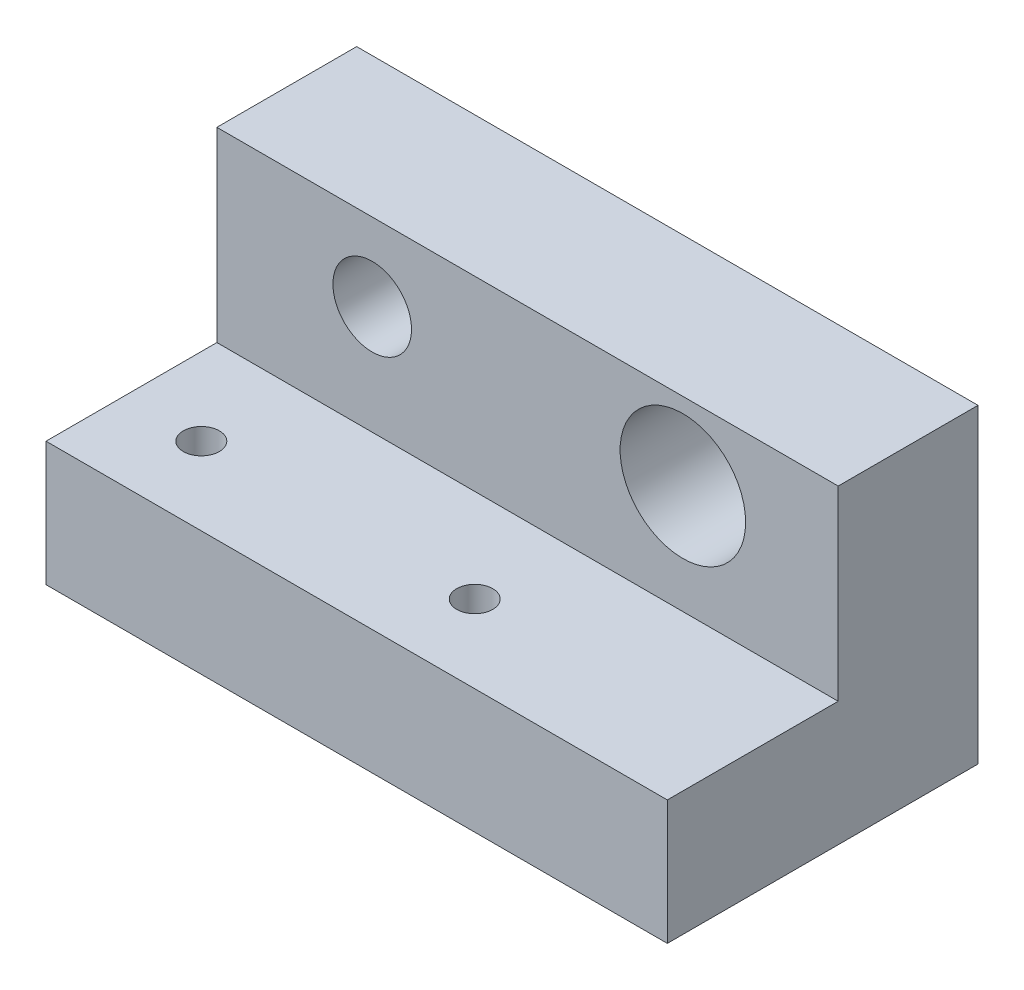
ISO-10303-21;
HEADER;
FILE_DESCRIPTION(('STEP AP214'),'2;1');
FILE_NAME('part.step','',(''),(''),'','','');
FILE_SCHEMA(('AUTOMOTIVE_DESIGN { 1 0 10303 214 1 1 1 1 }'));
ENDSEC;
DATA;
#1=APPLICATION_CONTEXT('core data for automotive mechanical design processes');
#2=APPLICATION_PROTOCOL_DEFINITION('international standard','automotive_design',2000,#1);
#3=PRODUCT_CONTEXT('',#1,'mechanical');
#4=PRODUCT('Part','Part','',(#3));
#5=PRODUCT_RELATED_PRODUCT_CATEGORY('part','',(#4));
#6=PRODUCT_DEFINITION_FORMATION('','',#4);
#7=PRODUCT_DEFINITION_CONTEXT('part definition',#1,'design');
#8=PRODUCT_DEFINITION('design','',#6,#7);
#9=PRODUCT_DEFINITION_SHAPE('','',#8);
#10=(LENGTH_UNIT() NAMED_UNIT(*) SI_UNIT(.MILLI.,.METRE.));
#11=(NAMED_UNIT(*) PLANE_ANGLE_UNIT() SI_UNIT($,.RADIAN.));
#12=(NAMED_UNIT(*) SI_UNIT($,.STERADIAN.) SOLID_ANGLE_UNIT());
#13=UNCERTAINTY_MEASURE_WITH_UNIT(LENGTH_MEASURE(1.E-05),#10,'distance_accuracy_value','');
#14=(GEOMETRIC_REPRESENTATION_CONTEXT(3) GLOBAL_UNCERTAINTY_ASSIGNED_CONTEXT((#13)) GLOBAL_UNIT_ASSIGNED_CONTEXT((#10,
#11,#12)) REPRESENTATION_CONTEXT('',''));
#15=CARTESIAN_POINT('',(0.,0.,0.));
#16=DIRECTION('',(0.,0.,1.));
#17=DIRECTION('',(1.,0.,0.));
#18=AXIS2_PLACEMENT_3D('',#15,#16,#17);
#19=CARTESIAN_POINT('',(-50.8,10.16,0.));
#20=DIRECTION('',(0.,0.,1.));
#21=DIRECTION('',(1.,0.,0.));
#22=AXIS2_PLACEMENT_3D('',#19,#20,#21);
#23=PLANE('',#22);
#24=DIRECTION('',(0.,-1.,0.));
#25=VECTOR('',#24,1.);
#26=CARTESIAN_POINT('',(0.,10.16,0.));
#27=LINE('',#26,#25);
#28=CARTESIAN_POINT('',(0.,10.16,0.));
#29=VERTEX_POINT('',#28);
#30=CARTESIAN_POINT('',(0.,0.,0.));
#31=VERTEX_POINT('',#30);
#32=EDGE_CURVE('E118',#29,#31,#27,.T.);
#33=ORIENTED_EDGE('',*,*,#32,.F.);
#34=DIRECTION('',(1.,0.,0.));
#35=VECTOR('',#34,1.);
#36=CARTESIAN_POINT('',(-50.8,10.16,0.));
#37=LINE('',#36,#35);
#38=CARTESIAN_POINT('',(-50.8,10.16,0.));
#39=VERTEX_POINT('',#38);
#40=EDGE_CURVE('E11',#39,#29,#37,.T.);
#41=ORIENTED_EDGE('',*,*,#40,.F.);
#42=DIRECTION('',(0.,-1.,0.));
#43=VECTOR('',#42,1.);
#44=CARTESIAN_POINT('',(-50.8,10.16,0.));
#45=LINE('',#44,#43);
#46=CARTESIAN_POINT('',(-50.8,0.,0.));
#47=VERTEX_POINT('',#46);
#48=EDGE_CURVE('E133',#39,#47,#45,.T.);
#49=ORIENTED_EDGE('',*,*,#48,.T.);
#50=DIRECTION('',(1.,0.,0.));
#51=VECTOR('',#50,1.);
#52=CARTESIAN_POINT('',(-50.8,0.,0.));
#53=LINE('',#52,#51);
#54=EDGE_CURVE('E82',#47,#31,#53,.T.);
#55=ORIENTED_EDGE('',*,*,#54,.T.);
#56=EDGE_LOOP('',(#33,#41,#49,#55));
#57=FACE_BOUND('',#56,.T.);
#58=ADVANCED_FACE('F32',(#57),#23,.T.);
#59=CARTESIAN_POINT('',(-50.8,10.16,-13.97));
#60=DIRECTION('',(0.,1.,0.));
#61=DIRECTION('',(0.,0.,1.));
#62=AXIS2_PLACEMENT_3D('',#59,#60,#61);
#63=PLANE('',#62);
#64=CARTESIAN_POINT('',(-44.45,10.16,-6.35));
#65=DIRECTION('',(0.,1.,0.));
#66=DIRECTION('',(0.,0.,1.));
#67=AXIS2_PLACEMENT_3D('',#64,#65,#66);
#68=CIRCLE('',#67,1.4732);
#69=CARTESIAN_POINT('',(-44.45,10.16,-4.8768));
#70=VERTEX_POINT('',#69);
#71=EDGE_CURVE('E156',#70,#70,#68,.T.);
#72=ORIENTED_EDGE('',*,*,#71,.F.);
#73=EDGE_LOOP('',(#72));
#74=FACE_BOUND('',#73,.T.);
#75=CARTESIAN_POINT('',(-22.098,10.16,-6.35));
#76=DIRECTION('',(0.,1.,0.));
#77=DIRECTION('',(0.,0.,1.));
#78=AXIS2_PLACEMENT_3D('',#75,#76,#77);
#79=CIRCLE('',#78,1.4732);
#80=CARTESIAN_POINT('',(-22.098,10.16,-4.8768));
#81=VERTEX_POINT('',#80);
#82=EDGE_CURVE('E145',#81,#81,#79,.T.);
#83=ORIENTED_EDGE('',*,*,#82,.F.);
#84=EDGE_LOOP('',(#83));
#85=FACE_BOUND('',#84,.T.);
#86=DIRECTION('',(0.,0.,1.));
#87=VECTOR('',#86,1.);
#88=CARTESIAN_POINT('',(0.,10.16,-13.97));
#89=LINE('',#88,#87);
#90=CARTESIAN_POINT('',(0.,10.16,-13.97));
#91=VERTEX_POINT('',#90);
#92=EDGE_CURVE('E131',#91,#29,#89,.T.);
#93=ORIENTED_EDGE('',*,*,#92,.F.);
#94=DIRECTION('',(1.,0.,0.));
#95=VECTOR('',#94,1.);
#96=CARTESIAN_POINT('',(-50.8,10.16,-13.97));
#97=LINE('',#96,#95);
#98=CARTESIAN_POINT('',(-50.8,10.16,-13.97));
#99=VERTEX_POINT('',#98);
#100=EDGE_CURVE('E41',#99,#91,#97,.T.);
#101=ORIENTED_EDGE('',*,*,#100,.F.);
#102=DIRECTION('',(0.,0.,1.));
#103=VECTOR('',#102,1.);
#104=CARTESIAN_POINT('',(-50.8,10.16,-13.97));
#105=LINE('',#104,#103);
#106=EDGE_CURVE('E108',#99,#39,#105,.T.);
#107=ORIENTED_EDGE('',*,*,#106,.T.);
#108=ORIENTED_EDGE('',*,*,#40,.T.);
#109=EDGE_LOOP('',(#93,#101,#107,#108));
#110=FACE_BOUND('',#109,.T.);
#111=ADVANCED_FACE('F168',(#74,#85,#110),#63,.T.);
#112=CARTESIAN_POINT('',(-50.8,25.4,-13.97));
#113=DIRECTION('',(0.,0.,1.));
#114=DIRECTION('',(0.,-1.,0.));
#115=AXIS2_PLACEMENT_3D('',#112,#113,#114);
#116=PLANE('',#115);
#117=CARTESIAN_POINT('',(-38.1,19.05,-13.97));
#118=DIRECTION('',(0.,0.,1.));
#119=DIRECTION('',(1.,0.,0.));
#120=AXIS2_PLACEMENT_3D('',#117,#118,#119);
#121=CIRCLE('',#120,3.2131);
#122=CARTESIAN_POINT('',(-34.8869,19.05,-13.97));
#123=VERTEX_POINT('',#122);
#124=EDGE_CURVE('E141',#123,#123,#121,.T.);
#125=ORIENTED_EDGE('',*,*,#124,.F.);
#126=EDGE_LOOP('',(#125));
#127=FACE_BOUND('',#126,.T.);
#128=CARTESIAN_POINT('',(-12.7,19.05,-13.97));
#129=DIRECTION('',(0.,0.,1.));
#130=DIRECTION('',(1.,0.,0.));
#131=AXIS2_PLACEMENT_3D('',#128,#129,#130);
#132=CIRCLE('',#131,5.1308);
#133=CARTESIAN_POINT('',(-7.5692,19.05,-13.97));
#134=VERTEX_POINT('',#133);
#135=EDGE_CURVE('E147',#134,#134,#132,.T.);
#136=ORIENTED_EDGE('',*,*,#135,.F.);
#137=EDGE_LOOP('',(#136));
#138=FACE_BOUND('',#137,.T.);
#139=DIRECTION('',(0.,-1.,0.));
#140=VECTOR('',#139,1.);
#141=CARTESIAN_POINT('',(0.,25.4,-13.97));
#142=LINE('',#141,#140);
#143=CARTESIAN_POINT('',(0.,25.4,-13.97));
#144=VERTEX_POINT('',#143);
#145=EDGE_CURVE('E95',#144,#91,#142,.T.);
#146=ORIENTED_EDGE('',*,*,#145,.F.);
#147=DIRECTION('',(1.,0.,0.));
#148=VECTOR('',#147,1.);
#149=CARTESIAN_POINT('',(-50.8,25.4,-13.97));
#150=LINE('',#149,#148);
#151=CARTESIAN_POINT('',(-50.8,25.4,-13.97));
#152=VERTEX_POINT('',#151);
#153=EDGE_CURVE('E90',#152,#144,#150,.T.);
#154=ORIENTED_EDGE('',*,*,#153,.F.);
#155=DIRECTION('',(0.,-1.,0.));
#156=VECTOR('',#155,1.);
#157=CARTESIAN_POINT('',(-50.8,25.4,-13.97));
#158=LINE('',#157,#156);
#159=EDGE_CURVE('E93',#152,#99,#158,.T.);
#160=ORIENTED_EDGE('',*,*,#159,.T.);
#161=ORIENTED_EDGE('',*,*,#100,.T.);
#162=EDGE_LOOP('',(#146,#154,#160,#161));
#163=FACE_BOUND('',#162,.T.);
#164=ADVANCED_FACE('F92',(#127,#138,#163),#116,.T.);
#165=CARTESIAN_POINT('',(-50.8,25.4,-25.4));
#166=DIRECTION('',(0.,1.,0.));
#167=DIRECTION('',(0.,0.,1.));
#168=AXIS2_PLACEMENT_3D('',#165,#166,#167);
#169=PLANE('',#168);
#170=DIRECTION('',(0.,0.,1.));
#171=VECTOR('',#170,1.);
#172=CARTESIAN_POINT('',(0.,25.4,-25.4));
#173=LINE('',#172,#171);
#174=CARTESIAN_POINT('',(0.,25.4,-25.4));
#175=VERTEX_POINT('',#174);
#176=EDGE_CURVE('E128',#175,#144,#173,.T.);
#177=ORIENTED_EDGE('',*,*,#176,.F.);
#178=DIRECTION('',(1.,0.,0.));
#179=VECTOR('',#178,1.);
#180=CARTESIAN_POINT('',(-50.8,25.4,-25.4));
#181=LINE('',#180,#179);
#182=CARTESIAN_POINT('',(-50.8,25.4,-25.4));
#183=VERTEX_POINT('',#182);
#184=EDGE_CURVE('E100',#183,#175,#181,.T.);
#185=ORIENTED_EDGE('',*,*,#184,.F.);
#186=DIRECTION('',(0.,0.,1.));
#187=VECTOR('',#186,1.);
#188=CARTESIAN_POINT('',(-50.8,25.4,-25.4));
#189=LINE('',#188,#187);
#190=EDGE_CURVE('E106',#183,#152,#189,.T.);
#191=ORIENTED_EDGE('',*,*,#190,.T.);
#192=ORIENTED_EDGE('',*,*,#153,.T.);
#193=EDGE_LOOP('',(#177,#185,#191,#192));
#194=FACE_BOUND('',#193,.T.);
#195=ADVANCED_FACE('F110',(#194),#169,.T.);
#196=CARTESIAN_POINT('',(-50.8,0.,-25.4));
#197=DIRECTION('',(0.,0.,-1.));
#198=DIRECTION('',(-1.,0.,0.));
#199=AXIS2_PLACEMENT_3D('',#196,#197,#198);
#200=PLANE('',#199);
#201=CARTESIAN_POINT('',(-38.1,19.05,-25.4));
#202=DIRECTION('',(0.,0.,-1.));
#203=DIRECTION('',(-1.,0.,0.));
#204=AXIS2_PLACEMENT_3D('',#201,#202,#203);
#205=CIRCLE('',#204,3.2131);
#206=CARTESIAN_POINT('',(-41.3131,19.05,-25.4));
#207=VERTEX_POINT('',#206);
#208=EDGE_CURVE('E35',#207,#207,#205,.T.);
#209=ORIENTED_EDGE('',*,*,#208,.F.);
#210=EDGE_LOOP('',(#209));
#211=FACE_BOUND('',#210,.T.);
#212=CARTESIAN_POINT('',(-12.7,19.05,-25.4));
#213=DIRECTION('',(0.,0.,-1.));
#214=DIRECTION('',(-1.,0.,0.));
#215=AXIS2_PLACEMENT_3D('',#212,#213,#214);
#216=CIRCLE('',#215,5.1308);
#217=CARTESIAN_POINT('',(-17.8308,19.05,-25.4));
#218=VERTEX_POINT('',#217);
#219=EDGE_CURVE('E139',#218,#218,#216,.T.);
#220=ORIENTED_EDGE('',*,*,#219,.F.);
#221=EDGE_LOOP('',(#220));
#222=FACE_BOUND('',#221,.T.);
#223=DIRECTION('',(0.,1.,0.));
#224=VECTOR('',#223,1.);
#225=CARTESIAN_POINT('',(0.,0.,-25.4));
#226=LINE('',#225,#224);
#227=CARTESIAN_POINT('',(0.,0.,-25.4));
#228=VERTEX_POINT('',#227);
#229=EDGE_CURVE('E125',#228,#175,#226,.T.);
#230=ORIENTED_EDGE('',*,*,#229,.F.);
#231=DIRECTION('',(1.,0.,0.));
#232=VECTOR('',#231,1.);
#233=CARTESIAN_POINT('',(-50.8,0.,-25.4));
#234=LINE('',#233,#232);
#235=CARTESIAN_POINT('',(-50.8,0.,-25.4));
#236=VERTEX_POINT('',#235);
#237=EDGE_CURVE('E137',#236,#228,#234,.T.);
#238=ORIENTED_EDGE('',*,*,#237,.F.);
#239=DIRECTION('',(0.,1.,0.));
#240=VECTOR('',#239,1.);
#241=CARTESIAN_POINT('',(-50.8,0.,-25.4));
#242=LINE('',#241,#240);
#243=EDGE_CURVE('E111',#236,#183,#242,.T.);
#244=ORIENTED_EDGE('',*,*,#243,.T.);
#245=ORIENTED_EDGE('',*,*,#184,.T.);
#246=EDGE_LOOP('',(#230,#238,#244,#245));
#247=FACE_BOUND('',#246,.T.);
#248=ADVANCED_FACE('F185',(#211,#222,#247),#200,.T.);
#249=CARTESIAN_POINT('',(-50.8,0.,0.));
#250=DIRECTION('',(0.,-1.,0.));
#251=DIRECTION('',(0.,0.,-1.));
#252=AXIS2_PLACEMENT_3D('',#249,#250,#251);
#253=PLANE('',#252);
#254=CARTESIAN_POINT('',(-44.45,0.,-6.35));
#255=DIRECTION('',(0.,1.,0.));
#256=DIRECTION('',(0.,0.,1.));
#257=AXIS2_PLACEMENT_3D('',#254,#255,#256);
#258=CIRCLE('',#257,1.4732);
#259=CARTESIAN_POINT('',(-44.45,0.,-4.8768));
#260=VERTEX_POINT('',#259);
#261=EDGE_CURVE('E122',#260,#260,#258,.T.);
#262=ORIENTED_EDGE('',*,*,#261,.T.);
#263=EDGE_LOOP('',(#262));
#264=FACE_BOUND('',#263,.T.);
#265=CARTESIAN_POINT('',(-22.098,0.,-6.35));
#266=DIRECTION('',(0.,1.,0.));
#267=DIRECTION('',(0.,0.,1.));
#268=AXIS2_PLACEMENT_3D('',#265,#266,#267);
#269=CIRCLE('',#268,1.4732);
#270=CARTESIAN_POINT('',(-22.098,0.,-4.8768));
#271=VERTEX_POINT('',#270);
#272=EDGE_CURVE('E159',#271,#271,#269,.T.);
#273=ORIENTED_EDGE('',*,*,#272,.T.);
#274=EDGE_LOOP('',(#273));
#275=FACE_BOUND('',#274,.T.);
#276=DIRECTION('',(0.,0.,-1.));
#277=VECTOR('',#276,1.);
#278=CARTESIAN_POINT('',(0.,0.,0.));
#279=LINE('',#278,#277);
#280=EDGE_CURVE('E121',#31,#228,#279,.T.);
#281=ORIENTED_EDGE('',*,*,#280,.F.);
#282=ORIENTED_EDGE('',*,*,#54,.F.);
#283=DIRECTION('',(0.,0.,-1.));
#284=VECTOR('',#283,1.);
#285=CARTESIAN_POINT('',(-50.8,0.,0.));
#286=LINE('',#285,#284);
#287=EDGE_CURVE('E113',#47,#236,#286,.T.);
#288=ORIENTED_EDGE('',*,*,#287,.T.);
#289=ORIENTED_EDGE('',*,*,#237,.T.);
#290=EDGE_LOOP('',(#281,#282,#288,#289));
#291=FACE_BOUND('',#290,.T.);
#292=ADVANCED_FACE('F164',(#264,#275,#291),#253,.T.);
#293=CARTESIAN_POINT('',(-50.8,0.,0.));
#294=DIRECTION('',(1.,0.,0.));
#295=DIRECTION('',(0.,0.,-1.));
#296=AXIS2_PLACEMENT_3D('',#293,#294,#295);
#297=PLANE('',#296);
#298=ORIENTED_EDGE('',*,*,#48,.F.);
#299=ORIENTED_EDGE('',*,*,#106,.F.);
#300=ORIENTED_EDGE('',*,*,#159,.F.);
#301=ORIENTED_EDGE('',*,*,#190,.F.);
#302=ORIENTED_EDGE('',*,*,#243,.F.);
#303=ORIENTED_EDGE('',*,*,#287,.F.);
#304=EDGE_LOOP('',(#298,#299,#300,#301,#302,#303));
#305=FACE_BOUND('',#304,.T.);
#306=ADVANCED_FACE('F104',(#305),#297,.F.);
#307=CARTESIAN_POINT('',(0.,0.,0.));
#308=DIRECTION('',(1.,0.,0.));
#309=DIRECTION('',(0.,0.,-1.));
#310=AXIS2_PLACEMENT_3D('',#307,#308,#309);
#311=PLANE('',#310);
#312=ORIENTED_EDGE('',*,*,#32,.T.);
#313=ORIENTED_EDGE('',*,*,#280,.T.);
#314=ORIENTED_EDGE('',*,*,#229,.T.);
#315=ORIENTED_EDGE('',*,*,#176,.T.);
#316=ORIENTED_EDGE('',*,*,#145,.T.);
#317=ORIENTED_EDGE('',*,*,#92,.T.);
#318=EDGE_LOOP('',(#312,#313,#314,#315,#316,#317));
#319=FACE_BOUND('',#318,.T.);
#320=ADVANCED_FACE('F167',(#319),#311,.T.);
#321=CARTESIAN_POINT('',(-22.098,0.,-6.35));
#322=DIRECTION('',(0.,1.,0.));
#323=DIRECTION('',(0.,0.,1.));
#324=AXIS2_PLACEMENT_3D('',#321,#322,#323);
#325=CYLINDRICAL_SURFACE('',#324,1.4732);
#326=ORIENTED_EDGE('',*,*,#272,.F.);
#327=EDGE_LOOP('',(#326));
#328=FACE_BOUND('',#327,.T.);
#329=ORIENTED_EDGE('',*,*,#82,.T.);
#330=EDGE_LOOP('',(#329));
#331=FACE_BOUND('',#330,.T.);
#332=ADVANCED_FACE('F197',(#328,#331),#325,.F.);
#333=CARTESIAN_POINT('',(-44.45,0.,-6.35));
#334=DIRECTION('',(0.,1.,0.));
#335=DIRECTION('',(0.,0.,1.));
#336=AXIS2_PLACEMENT_3D('',#333,#334,#335);
#337=CYLINDRICAL_SURFACE('',#336,1.4732);
#338=ORIENTED_EDGE('',*,*,#261,.F.);
#339=EDGE_LOOP('',(#338));
#340=FACE_BOUND('',#339,.T.);
#341=ORIENTED_EDGE('',*,*,#71,.T.);
#342=EDGE_LOOP('',(#341));
#343=FACE_BOUND('',#342,.T.);
#344=ADVANCED_FACE('F200',(#340,#343),#337,.F.);
#345=CARTESIAN_POINT('',(-12.7,19.05,-64.77));
#346=DIRECTION('',(0.,0.,1.));
#347=DIRECTION('',(1.,0.,0.));
#348=AXIS2_PLACEMENT_3D('',#345,#346,#347);
#349=CYLINDRICAL_SURFACE('',#348,5.1308);
#350=ORIENTED_EDGE('',*,*,#219,.T.);
#351=EDGE_LOOP('',(#350));
#352=FACE_BOUND('',#351,.T.);
#353=ORIENTED_EDGE('',*,*,#135,.T.);
#354=EDGE_LOOP('',(#353));
#355=FACE_BOUND('',#354,.T.);
#356=ADVANCED_FACE('F207',(#352,#355),#349,.F.);
#357=CARTESIAN_POINT('',(-38.1,19.05,-64.77));
#358=DIRECTION('',(0.,0.,1.));
#359=DIRECTION('',(1.,0.,0.));
#360=AXIS2_PLACEMENT_3D('',#357,#358,#359);
#361=CYLINDRICAL_SURFACE('',#360,3.2131);
#362=ORIENTED_EDGE('',*,*,#208,.T.);
#363=EDGE_LOOP('',(#362));
#364=FACE_BOUND('',#363,.T.);
#365=ORIENTED_EDGE('',*,*,#124,.T.);
#366=EDGE_LOOP('',(#365));
#367=FACE_BOUND('',#366,.T.);
#368=ADVANCED_FACE('F213',(#364,#367),#361,.F.);
#369=CLOSED_SHELL('',(#58,#111,#164,#195,#248,#292,#306,#320,#332,#344,#356,#368));
#370=MANIFOLD_SOLID_BREP('B2',#369);
#371=ADVANCED_BREP_SHAPE_REPRESENTATION('',(#18,#370),#14);
#372=SHAPE_DEFINITION_REPRESENTATION(#9,#371);
ENDSEC;
END-ISO-10303-21;
